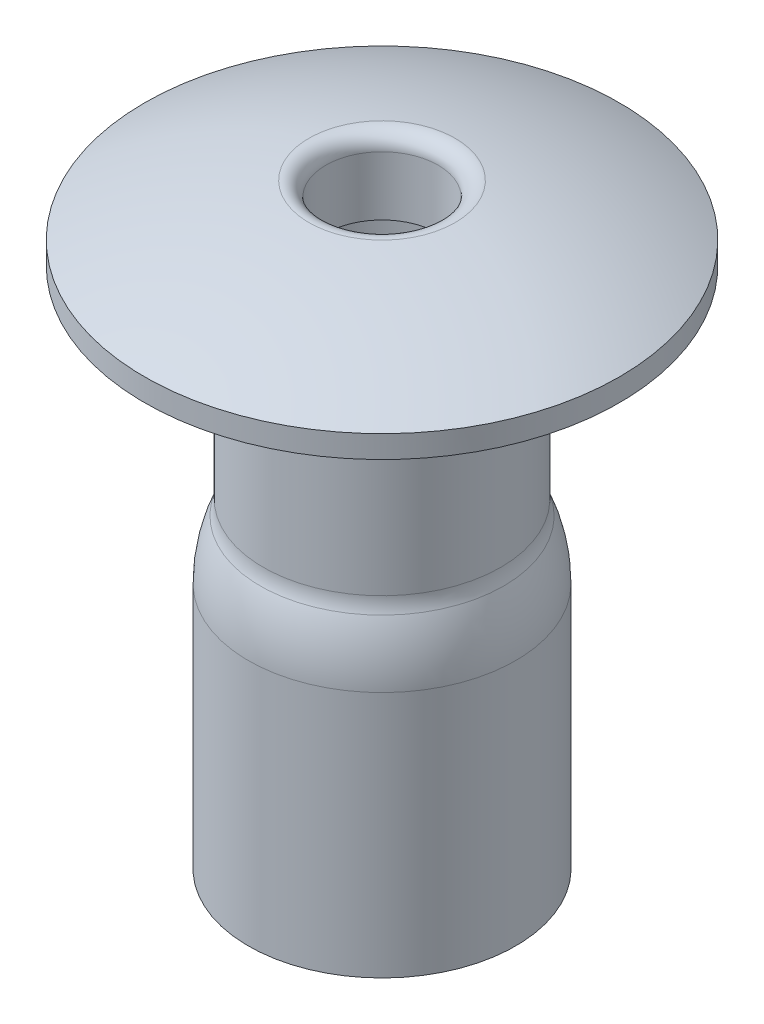
ISO-10303-21;
HEADER;
FILE_DESCRIPTION(('STEP AP214'),'2;1');
FILE_NAME('part.step','',(''),(''),'','','');
FILE_SCHEMA(('AUTOMOTIVE_DESIGN { 1 0 10303 214 1 1 1 1 }'));
ENDSEC;
DATA;
#1=APPLICATION_CONTEXT('core data for automotive mechanical design processes');
#2=APPLICATION_PROTOCOL_DEFINITION('international standard','automotive_design',2000,#1);
#3=PRODUCT_CONTEXT('',#1,'mechanical');
#4=PRODUCT('Part','Part','',(#3));
#5=PRODUCT_RELATED_PRODUCT_CATEGORY('part','',(#4));
#6=PRODUCT_DEFINITION_FORMATION('','',#4);
#7=PRODUCT_DEFINITION_CONTEXT('part definition',#1,'design');
#8=PRODUCT_DEFINITION('design','',#6,#7);
#9=PRODUCT_DEFINITION_SHAPE('','',#8);
#10=(LENGTH_UNIT() NAMED_UNIT(*) SI_UNIT(.MILLI.,.METRE.));
#11=(NAMED_UNIT(*) PLANE_ANGLE_UNIT() SI_UNIT($,.RADIAN.));
#12=(NAMED_UNIT(*) SI_UNIT($,.STERADIAN.) SOLID_ANGLE_UNIT());
#13=UNCERTAINTY_MEASURE_WITH_UNIT(LENGTH_MEASURE(1.E-05),#10,'distance_accuracy_value','');
#14=(GEOMETRIC_REPRESENTATION_CONTEXT(3) GLOBAL_UNCERTAINTY_ASSIGNED_CONTEXT((#13)) GLOBAL_UNIT_ASSIGNED_CONTEXT((#10,
#11,#12)) REPRESENTATION_CONTEXT('',''));
#15=CARTESIAN_POINT('',(0.,0.,0.));
#16=DIRECTION('',(0.,0.,1.));
#17=DIRECTION('',(1.,0.,0.));
#18=AXIS2_PLACEMENT_3D('',#15,#16,#17);
#19=CARTESIAN_POINT('',(1.5875,-6.985,0.));
#20=DIRECTION('',(0.,1.,0.));
#21=DIRECTION('',(-1.,0.,0.));
#22=AXIS2_PLACEMENT_3D('',#19,#20,#21);
#23=PLANE('',#22);
#24=CARTESIAN_POINT('',(0.,-6.985,0.));
#25=DIRECTION('',(0.,1.,0.));
#26=DIRECTION('',(-1.,0.,0.));
#27=AXIS2_PLACEMENT_3D('',#24,#25,#26);
#28=CIRCLE('',#27,1.7875);
#29=CARTESIAN_POINT('',(-1.7875,-6.985,0.));
#30=VERTEX_POINT('',#29);
#31=EDGE_CURVE('E80',#30,#30,#28,.T.);
#32=ORIENTED_EDGE('',*,*,#31,.F.);
#33=EDGE_LOOP('',(#32));
#34=FACE_BOUND('',#33,.T.);
#35=CARTESIAN_POINT('',(0.,-6.985,0.));
#36=DIRECTION('',(0.,1.,0.));
#37=DIRECTION('',(-1.,0.,0.));
#38=AXIS2_PLACEMENT_3D('',#35,#36,#37);
#39=CIRCLE('',#38,1.5875);
#40=CARTESIAN_POINT('',(-1.5875,-6.985,0.));
#41=VERTEX_POINT('',#40);
#42=EDGE_CURVE('E41',#41,#41,#39,.T.);
#43=ORIENTED_EDGE('',*,*,#42,.T.);
#44=EDGE_LOOP('',(#43));
#45=FACE_BOUND('',#44,.T.);
#46=ADVANCED_FACE('F30',(#34,#45),#23,.F.);
#47=CARTESIAN_POINT('',(0.,1.016,0.));
#48=DIRECTION('',(0.,1.,0.));
#49=DIRECTION('',(-1.,0.,0.));
#50=AXIS2_PLACEMENT_3D('',#47,#48,#49);
#51=CYLINDRICAL_SURFACE('',#50,1.5875);
#52=ORIENTED_EDGE('',*,*,#42,.F.);
#53=EDGE_LOOP('',(#52));
#54=FACE_BOUND('',#53,.T.);
#55=CARTESIAN_POINT('',(0.,-3.67979589711327,0.));
#56=DIRECTION('',(0.,1.,0.));
#57=DIRECTION('',(-1.,0.,0.));
#58=AXIS2_PLACEMENT_3D('',#55,#56,#57);
#59=CIRCLE('',#58,1.5875);
#60=CARTESIAN_POINT('',(-1.5875,-3.67979589711327,0.));
#61=VERTEX_POINT('',#60);
#62=EDGE_CURVE('E45',#61,#61,#59,.T.);
#63=ORIENTED_EDGE('',*,*,#62,.T.);
#64=EDGE_LOOP('',(#63));
#65=FACE_BOUND('',#64,.T.);
#66=ADVANCED_FACE('F88',(#54,#65),#51,.F.);
#67=CARTESIAN_POINT('',(0.,-3.67979589711327,0.));
#68=DIRECTION('',(0.,1.,0.));
#69=DIRECTION('',(-1.,0.,0.));
#70=AXIS2_PLACEMENT_3D('',#67,#68,#69);
#71=DEGENERATE_TOROIDAL_SURFACE('',#70,0.2125,1.8,.F.);
#72=ORIENTED_EDGE('',*,*,#62,.F.);
#73=EDGE_LOOP('',(#72));
#74=FACE_BOUND('',#73,.T.);
#75=CARTESIAN_POINT('',(0.,-2.97434285119172,0.));
#76=DIRECTION('',(0.,1.,0.));
#77=DIRECTION('',(-1.,0.,0.));
#78=AXIS2_PLACEMENT_3D('',#75,#76,#77);
#79=CIRCLE('',#78,1.4435);
#80=CARTESIAN_POINT('',(-1.4435,-2.97434285119172,0.));
#81=VERTEX_POINT('',#80);
#82=EDGE_CURVE('E50',#81,#81,#79,.T.);
#83=ORIENTED_EDGE('',*,*,#82,.T.);
#84=EDGE_LOOP('',(#83));
#85=FACE_BOUND('',#84,.T.);
#86=ADVANCED_FACE('F93',(#74,#85),#71,.T.);
#87=CARTESIAN_POINT('',(0.,-2.7,0.));
#88=DIRECTION('',(0.,1.,0.));
#89=DIRECTION('',(-1.,0.,0.));
#90=AXIS2_PLACEMENT_3D('',#87,#88,#89);
#91=TOROIDAL_SURFACE('',#90,2.0875,0.7);
#92=ORIENTED_EDGE('',*,*,#82,.F.);
#93=EDGE_LOOP('',(#92));
#94=FACE_BOUND('',#93,.T.);
#95=CARTESIAN_POINT('',(0.,-2.7,0.));
#96=DIRECTION('',(0.,1.,0.));
#97=DIRECTION('',(-1.,0.,0.));
#98=AXIS2_PLACEMENT_3D('',#95,#96,#97);
#99=CIRCLE('',#98,1.3875);
#100=CARTESIAN_POINT('',(-1.3875,-2.7,0.));
#101=VERTEX_POINT('',#100);
#102=EDGE_CURVE('E53',#101,#101,#99,.T.);
#103=ORIENTED_EDGE('',*,*,#102,.T.);
#104=EDGE_LOOP('',(#103));
#105=FACE_BOUND('',#104,.T.);
#106=ADVANCED_FACE('F99',(#94,#105),#91,.T.);
#107=CARTESIAN_POINT('',(0.,1.016,0.));
#108=DIRECTION('',(0.,1.,0.));
#109=DIRECTION('',(-1.,0.,0.));
#110=AXIS2_PLACEMENT_3D('',#107,#108,#109);
#111=CYLINDRICAL_SURFACE('',#110,1.3875);
#112=ORIENTED_EDGE('',*,*,#102,.F.);
#113=EDGE_LOOP('',(#112));
#114=FACE_BOUND('',#113,.T.);
#115=CARTESIAN_POINT('',(0.,0.,0.));
#116=DIRECTION('',(0.,1.,0.));
#117=DIRECTION('',(-1.,0.,0.));
#118=AXIS2_PLACEMENT_3D('',#115,#116,#117);
#119=CIRCLE('',#118,1.3875);
#120=CARTESIAN_POINT('',(-1.3875,0.,0.));
#121=VERTEX_POINT('',#120);
#122=EDGE_CURVE('E56',#121,#121,#119,.T.);
#123=ORIENTED_EDGE('',*,*,#122,.T.);
#124=EDGE_LOOP('',(#123));
#125=FACE_BOUND('',#124,.T.);
#126=ADVANCED_FACE('F105',(#114,#125),#111,.F.);
#127=CARTESIAN_POINT('',(1.3875,0.,0.));
#128=DIRECTION('',(0.,1.,0.));
#129=DIRECTION('',(-1.,0.,0.));
#130=AXIS2_PLACEMENT_3D('',#127,#128,#129);
#131=PLANE('',#130);
#132=ORIENTED_EDGE('',*,*,#122,.F.);
#133=EDGE_LOOP('',(#132));
#134=FACE_BOUND('',#133,.T.);
#135=CARTESIAN_POINT('',(0.,0.,0.));
#136=DIRECTION('',(0.,1.,0.));
#137=DIRECTION('',(-1.,0.,0.));
#138=AXIS2_PLACEMENT_3D('',#135,#136,#137);
#139=CIRCLE('',#138,0.75);
#140=CARTESIAN_POINT('',(-0.75,0.,0.));
#141=VERTEX_POINT('',#140);
#142=EDGE_CURVE('E59',#141,#141,#139,.T.);
#143=ORIENTED_EDGE('',*,*,#142,.T.);
#144=EDGE_LOOP('',(#143));
#145=FACE_BOUND('',#144,.T.);
#146=ADVANCED_FACE('F111',(#134,#145),#131,.F.);
#147=CARTESIAN_POINT('',(0.,1.016,0.));
#148=DIRECTION('',(0.,1.,0.));
#149=DIRECTION('',(-1.,0.,0.));
#150=AXIS2_PLACEMENT_3D('',#147,#148,#149);
#151=CYLINDRICAL_SURFACE('',#150,0.75);
#152=CARTESIAN_POINT('',(0.,0.789790181905769,0.));
#153=DIRECTION('',(0.,-1.,0.));
#154=DIRECTION('',(1.,0.,0.));
#155=AXIS2_PLACEMENT_3D('',#152,#153,#154);
#156=CIRCLE('',#155,0.75);
#157=CARTESIAN_POINT('',(0.75,0.789790181905769,0.));
#158=VERTEX_POINT('',#157);
#159=EDGE_CURVE('E37',#158,#158,#156,.F.);
#160=ORIENTED_EDGE('',*,*,#159,.T.);
#161=EDGE_LOOP('',(#160));
#162=FACE_BOUND('',#161,.T.);
#163=ORIENTED_EDGE('',*,*,#142,.F.);
#164=EDGE_LOOP('',(#163));
#165=FACE_BOUND('',#164,.T.);
#166=ADVANCED_FACE('F117',(#162,#165),#151,.F.);
#167=CARTESIAN_POINT('',(0.,-5.98873533519553,0.));
#168=DIRECTION('',(0.,1.,0.));
#169=DIRECTION('',(1.,0.,0.));
#170=AXIS2_PLACEMENT_3D('',#167,#168,#169);
#171=SPHERICAL_SURFACE('',#170,7.04477232535848);
#172=CARTESIAN_POINT('',(0.,0.987854491276243,0.));
#173=DIRECTION('',(0.,-1.,0.));
#174=DIRECTION('',(1.,0.,0.));
#175=AXIS2_PLACEMENT_3D('',#172,#173,#174);
#176=CIRCLE('',#175,0.977758410501996);
#177=CARTESIAN_POINT('',(0.977758410501996,0.987854491276243,0.));
#178=VERTEX_POINT('',#177);
#179=EDGE_CURVE('E10',#178,#178,#176,.T.);
#180=ORIENTED_EDGE('',*,*,#179,.T.);
#181=EDGE_LOOP('',(#180));
#182=FACE_BOUND('',#181,.T.);
#183=CARTESIAN_POINT('',(0.,0.3,0.));
#184=DIRECTION('',(0.,1.,0.));
#185=DIRECTION('',(-1.,0.,0.));
#186=AXIS2_PLACEMENT_3D('',#183,#184,#185);
#187=CIRCLE('',#186,3.175);
#188=CARTESIAN_POINT('',(-3.175,0.299999999999999,0.));
#189=VERTEX_POINT('',#188);
#190=EDGE_CURVE('E62',#189,#189,#187,.T.);
#191=ORIENTED_EDGE('',*,*,#190,.T.);
#192=EDGE_LOOP('',(#191));
#193=FACE_BOUND('',#192,.T.);
#194=ADVANCED_FACE('F122',(#182,#193),#171,.T.);
#195=CARTESIAN_POINT('',(0.,1.016,0.));
#196=DIRECTION('',(0.,1.,0.));
#197=DIRECTION('',(-1.,0.,0.));
#198=AXIS2_PLACEMENT_3D('',#195,#196,#197);
#199=CYLINDRICAL_SURFACE('',#198,3.175);
#200=ORIENTED_EDGE('',*,*,#190,.F.);
#201=EDGE_LOOP('',(#200));
#202=FACE_BOUND('',#201,.T.);
#203=CARTESIAN_POINT('',(0.,0.,0.));
#204=DIRECTION('',(0.,1.,0.));
#205=DIRECTION('',(-1.,0.,0.));
#206=AXIS2_PLACEMENT_3D('',#203,#204,#205);
#207=CIRCLE('',#206,3.175);
#208=CARTESIAN_POINT('',(-3.175,0.,0.));
#209=VERTEX_POINT('',#208);
#210=EDGE_CURVE('E65',#209,#209,#207,.T.);
#211=ORIENTED_EDGE('',*,*,#210,.T.);
#212=EDGE_LOOP('',(#211));
#213=FACE_BOUND('',#212,.T.);
#214=ADVANCED_FACE('F127',(#202,#213),#199,.T.);
#215=CARTESIAN_POINT('',(3.175,0.,0.));
#216=DIRECTION('',(0.,1.,0.));
#217=DIRECTION('',(-1.,0.,0.));
#218=AXIS2_PLACEMENT_3D('',#215,#216,#217);
#219=PLANE('',#218);
#220=ORIENTED_EDGE('',*,*,#210,.F.);
#221=EDGE_LOOP('',(#220));
#222=FACE_BOUND('',#221,.T.);
#223=CARTESIAN_POINT('',(0.,0.,0.));
#224=DIRECTION('',(0.,1.,0.));
#225=DIRECTION('',(-1.,0.,0.));
#226=AXIS2_PLACEMENT_3D('',#223,#224,#225);
#227=CIRCLE('',#226,1.5875);
#228=CARTESIAN_POINT('',(-1.5875,0.,0.));
#229=VERTEX_POINT('',#228);
#230=EDGE_CURVE('E68',#229,#229,#227,.T.);
#231=ORIENTED_EDGE('',*,*,#230,.T.);
#232=EDGE_LOOP('',(#231));
#233=FACE_BOUND('',#232,.T.);
#234=ADVANCED_FACE('F132',(#222,#233),#219,.F.);
#235=CARTESIAN_POINT('',(0.,1.016,0.));
#236=DIRECTION('',(0.,1.,0.));
#237=DIRECTION('',(-1.,0.,0.));
#238=AXIS2_PLACEMENT_3D('',#235,#236,#237);
#239=CYLINDRICAL_SURFACE('',#238,1.5875);
#240=ORIENTED_EDGE('',*,*,#230,.F.);
#241=EDGE_LOOP('',(#240));
#242=FACE_BOUND('',#241,.T.);
#243=CARTESIAN_POINT('',(0.,-2.7,0.));
#244=DIRECTION('',(0.,1.,0.));
#245=DIRECTION('',(-1.,0.,0.));
#246=AXIS2_PLACEMENT_3D('',#243,#244,#245);
#247=CIRCLE('',#246,1.5875);
#248=CARTESIAN_POINT('',(-1.5875,-2.7,0.));
#249=VERTEX_POINT('',#248);
#250=EDGE_CURVE('E71',#249,#249,#247,.T.);
#251=ORIENTED_EDGE('',*,*,#250,.T.);
#252=EDGE_LOOP('',(#251));
#253=FACE_BOUND('',#252,.T.);
#254=ADVANCED_FACE('F136',(#242,#253),#239,.T.);
#255=CARTESIAN_POINT('',(0.,-2.7,0.));
#256=DIRECTION('',(0.,1.,0.));
#257=DIRECTION('',(-1.,0.,0.));
#258=AXIS2_PLACEMENT_3D('',#255,#256,#257);
#259=TOROIDAL_SURFACE('',#258,2.0875,0.5);
#260=ORIENTED_EDGE('',*,*,#250,.F.);
#261=EDGE_LOOP('',(#260));
#262=FACE_BOUND('',#261,.T.);
#263=CARTESIAN_POINT('',(0.,-2.89595917942266,0.));
#264=DIRECTION('',(0.,1.,0.));
#265=DIRECTION('',(-1.,0.,0.));
#266=AXIS2_PLACEMENT_3D('',#263,#264,#265);
#267=CIRCLE('',#266,1.6275);
#268=CARTESIAN_POINT('',(-1.6275,-2.89595917942266,0.));
#269=VERTEX_POINT('',#268);
#270=EDGE_CURVE('E74',#269,#269,#267,.T.);
#271=ORIENTED_EDGE('',*,*,#270,.T.);
#272=EDGE_LOOP('',(#271));
#273=FACE_BOUND('',#272,.T.);
#274=ADVANCED_FACE('F140',(#262,#273),#259,.F.);
#275=CARTESIAN_POINT('',(0.,-3.67979589711327,0.));
#276=DIRECTION('',(0.,1.,0.));
#277=DIRECTION('',(-1.,0.,0.));
#278=AXIS2_PLACEMENT_3D('',#275,#276,#277);
#279=DEGENERATE_TOROIDAL_SURFACE('',#278,0.2125,2.,.F.);
#280=ORIENTED_EDGE('',*,*,#270,.F.);
#281=EDGE_LOOP('',(#280));
#282=FACE_BOUND('',#281,.T.);
#283=CARTESIAN_POINT('',(0.,-3.67979589711327,0.));
#284=DIRECTION('',(0.,1.,0.));
#285=DIRECTION('',(-1.,0.,0.));
#286=AXIS2_PLACEMENT_3D('',#283,#284,#285);
#287=CIRCLE('',#286,1.7875);
#288=CARTESIAN_POINT('',(-1.7875,-3.67979589711327,0.));
#289=VERTEX_POINT('',#288);
#290=EDGE_CURVE('E77',#289,#289,#287,.T.);
#291=ORIENTED_EDGE('',*,*,#290,.T.);
#292=EDGE_LOOP('',(#291));
#293=FACE_BOUND('',#292,.T.);
#294=ADVANCED_FACE('F144',(#282,#293),#279,.F.);
#295=CARTESIAN_POINT('',(0.,1.016,0.));
#296=DIRECTION('',(0.,1.,0.));
#297=DIRECTION('',(-1.,0.,0.));
#298=AXIS2_PLACEMENT_3D('',#295,#296,#297);
#299=CYLINDRICAL_SURFACE('',#298,1.7875);
#300=ORIENTED_EDGE('',*,*,#290,.F.);
#301=EDGE_LOOP('',(#300));
#302=FACE_BOUND('',#301,.T.);
#303=ORIENTED_EDGE('',*,*,#31,.T.);
#304=EDGE_LOOP('',(#303));
#305=FACE_BOUND('',#304,.T.);
#306=ADVANCED_FACE('F84',(#302,#305),#299,.T.);
#307=CARTESIAN_POINT('',(0.,0.789790181905769,0.));
#308=DIRECTION('',(0.,-1.,0.));
#309=DIRECTION('',(1.,0.,0.));
#310=AXIS2_PLACEMENT_3D('',#307,#308,#309);
#311=TOROIDAL_SURFACE('',#310,0.95,0.2);
#312=ORIENTED_EDGE('',*,*,#179,.F.);
#313=EDGE_LOOP('',(#312));
#314=FACE_BOUND('',#313,.T.);
#315=ORIENTED_EDGE('',*,*,#159,.F.);
#316=EDGE_LOOP('',(#315));
#317=FACE_BOUND('',#316,.T.);
#318=ADVANCED_FACE('F32',(#314,#317),#311,.T.);
#319=CLOSED_SHELL('',(#46,#66,#86,#106,#126,#146,#166,#194,#214,#234,#254,#274,#294,#306,#318));
#320=MANIFOLD_SOLID_BREP('B2',#319);
#321=ADVANCED_BREP_SHAPE_REPRESENTATION('',(#18,#320),#14);
#322=SHAPE_DEFINITION_REPRESENTATION(#9,#321);
ENDSEC;
END-ISO-10303-21;
